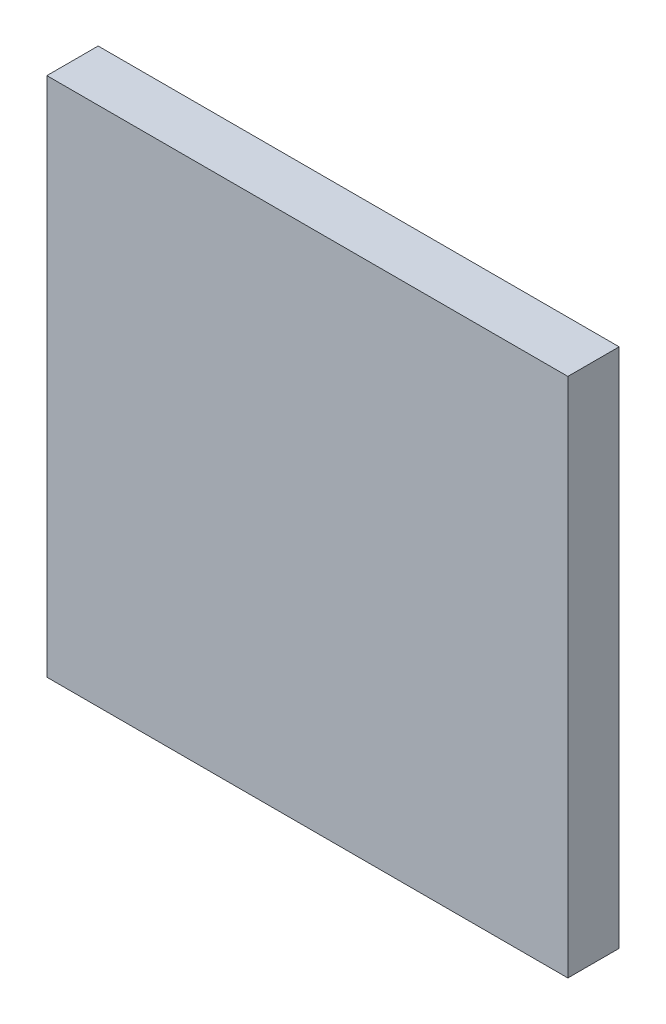
ISO-10303-21;
HEADER;
FILE_DESCRIPTION(('STEP AP214'),'2;1');
FILE_NAME('part.step','',(''),(''),'','','');
FILE_SCHEMA(('AUTOMOTIVE_DESIGN { 1 0 10303 214 1 1 1 1 }'));
ENDSEC;
DATA;
#1=APPLICATION_CONTEXT('core data for automotive mechanical design processes');
#2=APPLICATION_PROTOCOL_DEFINITION('international standard','automotive_design',2000,#1);
#3=PRODUCT_CONTEXT('',#1,'mechanical');
#4=PRODUCT('Part','Part','',(#3));
#5=PRODUCT_RELATED_PRODUCT_CATEGORY('part','',(#4));
#6=PRODUCT_DEFINITION_FORMATION('','',#4);
#7=PRODUCT_DEFINITION_CONTEXT('part definition',#1,'design');
#8=PRODUCT_DEFINITION('design','',#6,#7);
#9=PRODUCT_DEFINITION_SHAPE('','',#8);
#10=(LENGTH_UNIT() NAMED_UNIT(*) SI_UNIT(.MILLI.,.METRE.));
#11=(NAMED_UNIT(*) PLANE_ANGLE_UNIT() SI_UNIT($,.RADIAN.));
#12=(NAMED_UNIT(*) SI_UNIT($,.STERADIAN.) SOLID_ANGLE_UNIT());
#13=UNCERTAINTY_MEASURE_WITH_UNIT(LENGTH_MEASURE(1.E-05),#10,'distance_accuracy_value','');
#14=(GEOMETRIC_REPRESENTATION_CONTEXT(3) GLOBAL_UNCERTAINTY_ASSIGNED_CONTEXT((#13)) GLOBAL_UNIT_ASSIGNED_CONTEXT((#10,
#11,#12)) REPRESENTATION_CONTEXT('',''));
#15=CARTESIAN_POINT('',(0.,0.,0.));
#16=DIRECTION('',(0.,0.,1.));
#17=DIRECTION('',(1.,0.,0.));
#18=AXIS2_PLACEMENT_3D('',#15,#16,#17);
#19=CARTESIAN_POINT('',(0.,0.,2.5));
#20=DIRECTION('',(1.,0.,0.));
#21=DIRECTION('',(0.,1.,0.));
#22=AXIS2_PLACEMENT_3D('',#19,#20,#21);
#23=PLANE('',#22);
#24=DIRECTION('',(0.,-1.,0.));
#25=VECTOR('',#24,1.);
#26=CARTESIAN_POINT('',(0.,0.,0.));
#27=LINE('',#26,#25);
#28=CARTESIAN_POINT('',(0.,25.4,0.));
#29=VERTEX_POINT('',#28);
#30=CARTESIAN_POINT('',(0.,0.,0.));
#31=VERTEX_POINT('',#30);
#32=EDGE_CURVE('E96',#29,#31,#27,.T.);
#33=ORIENTED_EDGE('',*,*,#32,.T.);
#34=DIRECTION('',(0.,0.,-1.));
#35=VECTOR('',#34,1.);
#36=CARTESIAN_POINT('',(0.,0.,2.5));
#37=LINE('',#36,#35);
#38=CARTESIAN_POINT('',(0.,0.,2.5));
#39=VERTEX_POINT('',#38);
#40=EDGE_CURVE('E11',#39,#31,#37,.T.);
#41=ORIENTED_EDGE('',*,*,#40,.F.);
#42=DIRECTION('',(0.,-1.,0.));
#43=VECTOR('',#42,1.);
#44=CARTESIAN_POINT('',(0.,0.,2.5));
#45=LINE('',#44,#43);
#46=CARTESIAN_POINT('',(0.,25.4,2.5));
#47=VERTEX_POINT('',#46);
#48=EDGE_CURVE('E84',#47,#39,#45,.T.);
#49=ORIENTED_EDGE('',*,*,#48,.F.);
#50=DIRECTION('',(0.,0.,-1.));
#51=VECTOR('',#50,1.);
#52=CARTESIAN_POINT('',(0.,25.4,2.5));
#53=LINE('',#52,#51);
#54=EDGE_CURVE('E92',#47,#29,#53,.T.);
#55=ORIENTED_EDGE('',*,*,#54,.T.);
#56=EDGE_LOOP('',(#33,#41,#49,#55));
#57=FACE_BOUND('',#56,.T.);
#58=ADVANCED_FACE('F33',(#57),#23,.F.);
#59=CARTESIAN_POINT('',(0.,0.,2.5));
#60=DIRECTION('',(0.,1.,0.));
#61=DIRECTION('',(0.,0.,1.));
#62=AXIS2_PLACEMENT_3D('',#59,#60,#61);
#63=PLANE('',#62);
#64=DIRECTION('',(1.,0.,0.));
#65=VECTOR('',#64,1.);
#66=CARTESIAN_POINT('',(0.,0.,0.));
#67=LINE('',#66,#65);
#68=CARTESIAN_POINT('',(25.4,0.,0.));
#69=VERTEX_POINT('',#68);
#70=EDGE_CURVE('E88',#31,#69,#67,.T.);
#71=ORIENTED_EDGE('',*,*,#70,.T.);
#72=DIRECTION('',(0.,0.,-1.));
#73=VECTOR('',#72,1.);
#74=CARTESIAN_POINT('',(25.4,0.,2.5));
#75=LINE('',#74,#73);
#76=CARTESIAN_POINT('',(25.4,0.,2.5));
#77=VERTEX_POINT('',#76);
#78=EDGE_CURVE('E41',#77,#69,#75,.T.);
#79=ORIENTED_EDGE('',*,*,#78,.F.);
#80=DIRECTION('',(1.,0.,0.));
#81=VECTOR('',#80,1.);
#82=CARTESIAN_POINT('',(0.,0.,2.5));
#83=LINE('',#82,#81);
#84=EDGE_CURVE('E79',#39,#77,#83,.T.);
#85=ORIENTED_EDGE('',*,*,#84,.F.);
#86=ORIENTED_EDGE('',*,*,#40,.T.);
#87=EDGE_LOOP('',(#71,#79,#85,#86));
#88=FACE_BOUND('',#87,.T.);
#89=ADVANCED_FACE('F87',(#88),#63,.F.);
#90=CARTESIAN_POINT('',(25.4,0.,2.5));
#91=DIRECTION('',(-1.,0.,0.));
#92=DIRECTION('',(0.,-1.,0.));
#93=AXIS2_PLACEMENT_3D('',#90,#91,#92);
#94=PLANE('',#93);
#95=DIRECTION('',(0.,1.,0.));
#96=VECTOR('',#95,1.);
#97=CARTESIAN_POINT('',(25.4,0.,0.));
#98=LINE('',#97,#96);
#99=CARTESIAN_POINT('',(25.4,25.4,0.));
#100=VERTEX_POINT('',#99);
#101=EDGE_CURVE('E66',#69,#100,#98,.T.);
#102=ORIENTED_EDGE('',*,*,#101,.T.);
#103=DIRECTION('',(0.,0.,-1.));
#104=VECTOR('',#103,1.);
#105=CARTESIAN_POINT('',(25.4,25.4,2.5));
#106=LINE('',#105,#104);
#107=CARTESIAN_POINT('',(25.4,25.4,2.5));
#108=VERTEX_POINT('',#107);
#109=EDGE_CURVE('E89',#108,#100,#106,.T.);
#110=ORIENTED_EDGE('',*,*,#109,.F.);
#111=DIRECTION('',(0.,1.,0.));
#112=VECTOR('',#111,1.);
#113=CARTESIAN_POINT('',(25.4,0.,2.5));
#114=LINE('',#113,#112);
#115=EDGE_CURVE('E82',#77,#108,#114,.T.);
#116=ORIENTED_EDGE('',*,*,#115,.F.);
#117=ORIENTED_EDGE('',*,*,#78,.T.);
#118=EDGE_LOOP('',(#102,#110,#116,#117));
#119=FACE_BOUND('',#118,.T.);
#120=ADVANCED_FACE('F90',(#119),#94,.F.);
#121=CARTESIAN_POINT('',(0.,25.4,2.5));
#122=DIRECTION('',(0.,-1.,0.));
#123=DIRECTION('',(0.,0.,-1.));
#124=AXIS2_PLACEMENT_3D('',#121,#122,#123);
#125=PLANE('',#124);
#126=DIRECTION('',(-1.,0.,0.));
#127=VECTOR('',#126,1.);
#128=CARTESIAN_POINT('',(0.,25.4,0.));
#129=LINE('',#128,#127);
#130=EDGE_CURVE('E72',#100,#29,#129,.T.);
#131=ORIENTED_EDGE('',*,*,#130,.T.);
#132=ORIENTED_EDGE('',*,*,#54,.F.);
#133=DIRECTION('',(-1.,0.,0.));
#134=VECTOR('',#133,1.);
#135=CARTESIAN_POINT('',(0.,25.4,2.5));
#136=LINE('',#135,#134);
#137=EDGE_CURVE('E49',#108,#47,#136,.T.);
#138=ORIENTED_EDGE('',*,*,#137,.F.);
#139=ORIENTED_EDGE('',*,*,#109,.T.);
#140=EDGE_LOOP('',(#131,#132,#138,#139));
#141=FACE_BOUND('',#140,.T.);
#142=ADVANCED_FACE('F103',(#141),#125,.F.);
#143=CARTESIAN_POINT('',(0.,0.,2.5));
#144=DIRECTION('',(0.,0.,-1.));
#145=DIRECTION('',(-1.,0.,0.));
#146=AXIS2_PLACEMENT_3D('',#143,#144,#145);
#147=PLANE('',#146);
#148=ORIENTED_EDGE('',*,*,#48,.T.);
#149=ORIENTED_EDGE('',*,*,#84,.T.);
#150=ORIENTED_EDGE('',*,*,#115,.T.);
#151=ORIENTED_EDGE('',*,*,#137,.T.);
#152=EDGE_LOOP('',(#148,#149,#150,#151));
#153=FACE_BOUND('',#152,.T.);
#154=ADVANCED_FACE('F80',(#153),#147,.F.);
#155=CARTESIAN_POINT('',(0.,0.,0.));
#156=DIRECTION('',(0.,0.,-1.));
#157=DIRECTION('',(-1.,0.,0.));
#158=AXIS2_PLACEMENT_3D('',#155,#156,#157);
#159=PLANE('',#158);
#160=ORIENTED_EDGE('',*,*,#32,.F.);
#161=ORIENTED_EDGE('',*,*,#130,.F.);
#162=ORIENTED_EDGE('',*,*,#101,.F.);
#163=ORIENTED_EDGE('',*,*,#70,.F.);
#164=EDGE_LOOP('',(#160,#161,#162,#163));
#165=FACE_BOUND('',#164,.T.);
#166=ADVANCED_FACE('F106',(#165),#159,.T.);
#167=CLOSED_SHELL('',(#58,#89,#120,#142,#154,#166));
#168=MANIFOLD_SOLID_BREP('B2',#167);
#169=ADVANCED_BREP_SHAPE_REPRESENTATION('',(#18,#168),#14);
#170=SHAPE_DEFINITION_REPRESENTATION(#9,#169);
ENDSEC;
END-ISO-10303-21;
